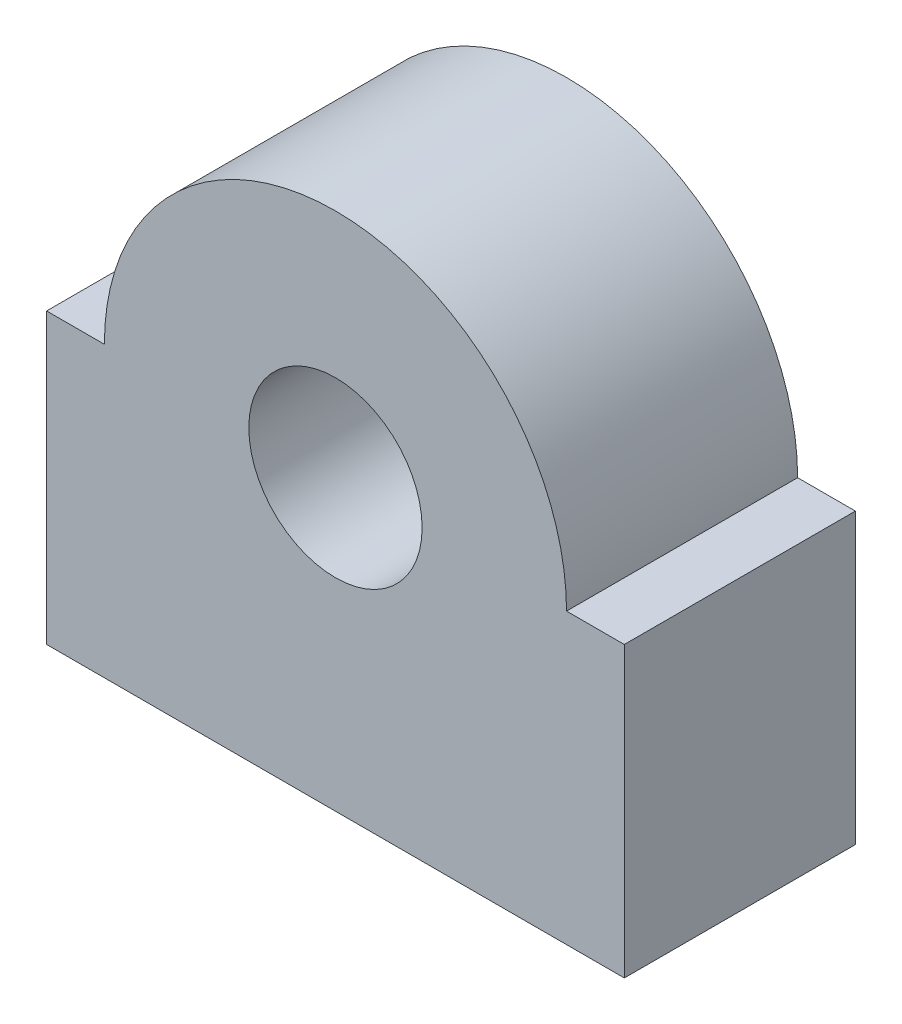
ISO-10303-21;
HEADER;
FILE_DESCRIPTION(('STEP AP214'),'2;1');
FILE_NAME('part.step','',(''),(''),'','','');
FILE_SCHEMA(('AUTOMOTIVE_DESIGN { 1 0 10303 214 1 1 1 1 }'));
ENDSEC;
DATA;
#1=APPLICATION_CONTEXT('core data for automotive mechanical design processes');
#2=APPLICATION_PROTOCOL_DEFINITION('international standard','automotive_design',2000,#1);
#3=PRODUCT_CONTEXT('',#1,'mechanical');
#4=PRODUCT('Part','Part','',(#3));
#5=PRODUCT_RELATED_PRODUCT_CATEGORY('part','',(#4));
#6=PRODUCT_DEFINITION_FORMATION('','',#4);
#7=PRODUCT_DEFINITION_CONTEXT('part definition',#1,'design');
#8=PRODUCT_DEFINITION('design','',#6,#7);
#9=PRODUCT_DEFINITION_SHAPE('','',#8);
#10=(LENGTH_UNIT() NAMED_UNIT(*) SI_UNIT(.MILLI.,.METRE.));
#11=(NAMED_UNIT(*) PLANE_ANGLE_UNIT() SI_UNIT($,.RADIAN.));
#12=(NAMED_UNIT(*) SI_UNIT($,.STERADIAN.) SOLID_ANGLE_UNIT());
#13=UNCERTAINTY_MEASURE_WITH_UNIT(LENGTH_MEASURE(1.E-05),#10,'distance_accuracy_value','');
#14=(GEOMETRIC_REPRESENTATION_CONTEXT(3) GLOBAL_UNCERTAINTY_ASSIGNED_CONTEXT((#13)) GLOBAL_UNIT_ASSIGNED_CONTEXT((#10,
#11,#12)) REPRESENTATION_CONTEXT('',''));
#15=CARTESIAN_POINT('',(0.,0.,0.));
#16=DIRECTION('',(0.,0.,1.));
#17=DIRECTION('',(1.,0.,0.));
#18=AXIS2_PLACEMENT_3D('',#15,#16,#17);
#19=CARTESIAN_POINT('',(0.,63.5,50.8));
#20=DIRECTION('',(0.,0.,-1.));
#21=DIRECTION('',(-1.,0.,0.));
#22=AXIS2_PLACEMENT_3D('',#19,#20,#21);
#23=PLANE('',#22);
#24=DIRECTION('',(0.,-1.,0.));
#25=VECTOR('',#24,1.);
#26=CARTESIAN_POINT('',(-63.5,0.,50.8));
#27=LINE('',#26,#25);
#28=CARTESIAN_POINT('',(-63.5,63.5,50.8));
#29=VERTEX_POINT('',#28);
#30=CARTESIAN_POINT('',(-63.5,0.,50.8));
#31=VERTEX_POINT('',#30);
#32=EDGE_CURVE('E129',#29,#31,#27,.T.);
#33=ORIENTED_EDGE('',*,*,#32,.T.);
#34=DIRECTION('',(1.,0.,0.));
#35=VECTOR('',#34,1.);
#36=CARTESIAN_POINT('',(-63.5,0.,50.8));
#37=LINE('',#36,#35);
#38=CARTESIAN_POINT('',(63.5,0.,50.8));
#39=VERTEX_POINT('',#38);
#40=EDGE_CURVE('E87',#31,#39,#37,.T.);
#41=ORIENTED_EDGE('',*,*,#40,.T.);
#42=DIRECTION('',(0.,1.,0.));
#43=VECTOR('',#42,1.);
#44=CARTESIAN_POINT('',(63.5,0.,50.8));
#45=LINE('',#44,#43);
#46=CARTESIAN_POINT('',(63.5,63.5,50.8));
#47=VERTEX_POINT('',#46);
#48=EDGE_CURVE('E100',#39,#47,#45,.T.);
#49=ORIENTED_EDGE('',*,*,#48,.T.);
#50=DIRECTION('',(-1.,0.,0.));
#51=VECTOR('',#50,1.);
#52=CARTESIAN_POINT('',(50.8,63.5,50.8));
#53=LINE('',#52,#51);
#54=CARTESIAN_POINT('',(50.8,63.5,50.8));
#55=VERTEX_POINT('',#54);
#56=EDGE_CURVE('E94',#47,#55,#53,.T.);
#57=ORIENTED_EDGE('',*,*,#56,.T.);
#58=CARTESIAN_POINT('',(0.,63.5,50.8));
#59=DIRECTION('',(0.,0.,1.));
#60=DIRECTION('',(-1.,0.,0.));
#61=AXIS2_PLACEMENT_3D('',#58,#59,#60);
#62=CIRCLE('',#61,50.8);
#63=CARTESIAN_POINT('',(-50.8,63.5,50.8));
#64=VERTEX_POINT('',#63);
#65=EDGE_CURVE('E98',#55,#64,#62,.T.);
#66=ORIENTED_EDGE('',*,*,#65,.T.);
#67=DIRECTION('',(-1.,0.,0.));
#68=VECTOR('',#67,1.);
#69=CARTESIAN_POINT('',(-63.5,63.5,50.8));
#70=LINE('',#69,#68);
#71=EDGE_CURVE('E50',#64,#29,#70,.T.);
#72=ORIENTED_EDGE('',*,*,#71,.T.);
#73=EDGE_LOOP('',(#33,#41,#49,#57,#66,#72));
#74=FACE_BOUND('',#73,.T.);
#75=CARTESIAN_POINT('',(0.,63.5,50.8));
#76=DIRECTION('',(0.,0.,1.));
#77=DIRECTION('',(1.,0.,0.));
#78=AXIS2_PLACEMENT_3D('',#75,#76,#77);
#79=CIRCLE('',#78,19.05);
#80=CARTESIAN_POINT('',(19.05,63.5,50.8));
#81=VERTEX_POINT('',#80);
#82=EDGE_CURVE('E122',#81,#81,#79,.T.);
#83=ORIENTED_EDGE('',*,*,#82,.F.);
#84=EDGE_LOOP('',(#83));
#85=FACE_BOUND('',#84,.T.);
#86=ADVANCED_FACE('F33',(#74,#85),#23,.F.);
#87=CARTESIAN_POINT('',(0.,63.5,0.));
#88=DIRECTION('',(0.,0.,-1.));
#89=DIRECTION('',(-1.,0.,0.));
#90=AXIS2_PLACEMENT_3D('',#87,#88,#89);
#91=PLANE('',#90);
#92=DIRECTION('',(0.,-1.,0.));
#93=VECTOR('',#92,1.);
#94=CARTESIAN_POINT('',(-63.5,0.,0.));
#95=LINE('',#94,#93);
#96=CARTESIAN_POINT('',(-63.5,63.5,0.));
#97=VERTEX_POINT('',#96);
#98=CARTESIAN_POINT('',(-63.5,0.,0.));
#99=VERTEX_POINT('',#98);
#100=EDGE_CURVE('E118',#97,#99,#95,.T.);
#101=ORIENTED_EDGE('',*,*,#100,.F.);
#102=DIRECTION('',(-1.,0.,0.));
#103=VECTOR('',#102,1.);
#104=CARTESIAN_POINT('',(-63.5,63.5,0.));
#105=LINE('',#104,#103);
#106=CARTESIAN_POINT('',(-50.8,63.5,0.));
#107=VERTEX_POINT('',#106);
#108=EDGE_CURVE('E79',#107,#97,#105,.T.);
#109=ORIENTED_EDGE('',*,*,#108,.F.);
#110=CARTESIAN_POINT('',(0.,63.5,0.));
#111=DIRECTION('',(0.,0.,1.));
#112=DIRECTION('',(-1.,0.,0.));
#113=AXIS2_PLACEMENT_3D('',#110,#111,#112);
#114=CIRCLE('',#113,50.8);
#115=CARTESIAN_POINT('',(50.8,63.5,0.));
#116=VERTEX_POINT('',#115);
#117=EDGE_CURVE('E73',#116,#107,#114,.T.);
#118=ORIENTED_EDGE('',*,*,#117,.F.);
#119=DIRECTION('',(-1.,0.,0.));
#120=VECTOR('',#119,1.);
#121=CARTESIAN_POINT('',(50.8,63.5,0.));
#122=LINE('',#121,#120);
#123=CARTESIAN_POINT('',(63.5,63.5,0.));
#124=VERTEX_POINT('',#123);
#125=EDGE_CURVE('E108',#124,#116,#122,.T.);
#126=ORIENTED_EDGE('',*,*,#125,.F.);
#127=DIRECTION('',(0.,1.,0.));
#128=VECTOR('',#127,1.);
#129=CARTESIAN_POINT('',(63.5,0.,0.));
#130=LINE('',#129,#128);
#131=CARTESIAN_POINT('',(63.5,0.,0.));
#132=VERTEX_POINT('',#131);
#133=EDGE_CURVE('E124',#132,#124,#130,.T.);
#134=ORIENTED_EDGE('',*,*,#133,.F.);
#135=DIRECTION('',(1.,0.,0.));
#136=VECTOR('',#135,1.);
#137=CARTESIAN_POINT('',(-63.5,0.,0.));
#138=LINE('',#137,#136);
#139=EDGE_CURVE('E121',#99,#132,#138,.T.);
#140=ORIENTED_EDGE('',*,*,#139,.F.);
#141=EDGE_LOOP('',(#101,#109,#118,#126,#134,#140));
#142=FACE_BOUND('',#141,.T.);
#143=CARTESIAN_POINT('',(0.,63.5,0.));
#144=DIRECTION('',(0.,0.,1.));
#145=DIRECTION('',(1.,0.,0.));
#146=AXIS2_PLACEMENT_3D('',#143,#144,#145);
#147=CIRCLE('',#146,19.05);
#148=CARTESIAN_POINT('',(19.05,63.5,0.));
#149=VERTEX_POINT('',#148);
#150=EDGE_CURVE('E222',#149,#149,#147,.T.);
#151=ORIENTED_EDGE('',*,*,#150,.T.);
#152=EDGE_LOOP('',(#151));
#153=FACE_BOUND('',#152,.T.);
#154=ADVANCED_FACE('F138',(#142,#153),#91,.T.);
#155=CARTESIAN_POINT('',(-63.5,0.,50.8));
#156=DIRECTION('',(1.,0.,0.));
#157=DIRECTION('',(0.,0.,-1.));
#158=AXIS2_PLACEMENT_3D('',#155,#156,#157);
#159=PLANE('',#158);
#160=ORIENTED_EDGE('',*,*,#100,.T.);
#161=DIRECTION('',(0.,0.,-1.));
#162=VECTOR('',#161,1.);
#163=CARTESIAN_POINT('',(-63.5,0.,50.8));
#164=LINE('',#163,#162);
#165=EDGE_CURVE('E11',#31,#99,#164,.T.);
#166=ORIENTED_EDGE('',*,*,#165,.F.);
#167=ORIENTED_EDGE('',*,*,#32,.F.);
#168=DIRECTION('',(0.,0.,-1.));
#169=VECTOR('',#168,1.);
#170=CARTESIAN_POINT('',(-63.5,63.5,50.8));
#171=LINE('',#170,#169);
#172=EDGE_CURVE('E114',#29,#97,#171,.T.);
#173=ORIENTED_EDGE('',*,*,#172,.T.);
#174=EDGE_LOOP('',(#160,#166,#167,#173));
#175=FACE_BOUND('',#174,.T.);
#176=ADVANCED_FACE('F35',(#175),#159,.F.);
#177=CARTESIAN_POINT('',(-63.5,0.,50.8));
#178=DIRECTION('',(0.,1.,0.));
#179=DIRECTION('',(0.,0.,1.));
#180=AXIS2_PLACEMENT_3D('',#177,#178,#179);
#181=PLANE('',#180);
#182=ORIENTED_EDGE('',*,*,#139,.T.);
#183=DIRECTION('',(0.,0.,-1.));
#184=VECTOR('',#183,1.);
#185=CARTESIAN_POINT('',(63.5,0.,50.8));
#186=LINE('',#185,#184);
#187=EDGE_CURVE('E42',#39,#132,#186,.T.);
#188=ORIENTED_EDGE('',*,*,#187,.F.);
#189=ORIENTED_EDGE('',*,*,#40,.F.);
#190=ORIENTED_EDGE('',*,*,#165,.T.);
#191=EDGE_LOOP('',(#182,#188,#189,#190));
#192=FACE_BOUND('',#191,.T.);
#193=ADVANCED_FACE('F163',(#192),#181,.F.);
#194=CARTESIAN_POINT('',(63.5,0.,50.8));
#195=DIRECTION('',(-1.,0.,0.));
#196=DIRECTION('',(0.,0.,1.));
#197=AXIS2_PLACEMENT_3D('',#194,#195,#196);
#198=PLANE('',#197);
#199=ORIENTED_EDGE('',*,*,#133,.T.);
#200=DIRECTION('',(0.,0.,-1.));
#201=VECTOR('',#200,1.);
#202=CARTESIAN_POINT('',(63.5,63.5,50.8));
#203=LINE('',#202,#201);
#204=EDGE_CURVE('E109',#47,#124,#203,.T.);
#205=ORIENTED_EDGE('',*,*,#204,.F.);
#206=ORIENTED_EDGE('',*,*,#48,.F.);
#207=ORIENTED_EDGE('',*,*,#187,.T.);
#208=EDGE_LOOP('',(#199,#205,#206,#207));
#209=FACE_BOUND('',#208,.T.);
#210=ADVANCED_FACE('F135',(#209),#198,.F.);
#211=CARTESIAN_POINT('',(50.8,63.5,50.8));
#212=DIRECTION('',(0.,-1.,0.));
#213=DIRECTION('',(0.,0.,-1.));
#214=AXIS2_PLACEMENT_3D('',#211,#212,#213);
#215=PLANE('',#214);
#216=ORIENTED_EDGE('',*,*,#125,.T.);
#217=DIRECTION('',(0.,0.,-1.));
#218=VECTOR('',#217,1.);
#219=CARTESIAN_POINT('',(50.8,63.5,50.8));
#220=LINE('',#219,#218);
#221=EDGE_CURVE('E105',#55,#116,#220,.T.);
#222=ORIENTED_EDGE('',*,*,#221,.F.);
#223=ORIENTED_EDGE('',*,*,#56,.F.);
#224=ORIENTED_EDGE('',*,*,#204,.T.);
#225=EDGE_LOOP('',(#216,#222,#223,#224));
#226=FACE_BOUND('',#225,.T.);
#227=ADVANCED_FACE('F106',(#226),#215,.F.);
#228=CARTESIAN_POINT('',(0.,63.5,50.8));
#229=DIRECTION('',(0.,0.,-1.));
#230=DIRECTION('',(-1.,0.,0.));
#231=AXIS2_PLACEMENT_3D('',#228,#229,#230);
#232=CYLINDRICAL_SURFACE('',#231,50.8);
#233=ORIENTED_EDGE('',*,*,#117,.T.);
#234=DIRECTION('',(0.,0.,-1.));
#235=VECTOR('',#234,1.);
#236=CARTESIAN_POINT('',(-50.8,63.5,50.8));
#237=LINE('',#236,#235);
#238=EDGE_CURVE('E110',#64,#107,#237,.T.);
#239=ORIENTED_EDGE('',*,*,#238,.F.);
#240=ORIENTED_EDGE('',*,*,#65,.F.);
#241=ORIENTED_EDGE('',*,*,#221,.T.);
#242=EDGE_LOOP('',(#233,#239,#240,#241));
#243=FACE_BOUND('',#242,.T.);
#244=ADVANCED_FACE('F112',(#243),#232,.T.);
#245=CARTESIAN_POINT('',(-63.5,63.5,50.8));
#246=DIRECTION('',(0.,-1.,0.));
#247=DIRECTION('',(0.,0.,-1.));
#248=AXIS2_PLACEMENT_3D('',#245,#246,#247);
#249=PLANE('',#248);
#250=ORIENTED_EDGE('',*,*,#108,.T.);
#251=ORIENTED_EDGE('',*,*,#172,.F.);
#252=ORIENTED_EDGE('',*,*,#71,.F.);
#253=ORIENTED_EDGE('',*,*,#238,.T.);
#254=EDGE_LOOP('',(#250,#251,#252,#253));
#255=FACE_BOUND('',#254,.T.);
#256=ADVANCED_FACE('F143',(#255),#249,.F.);
#257=CARTESIAN_POINT('',(0.,63.5,50.8));
#258=DIRECTION('',(0.,0.,-1.));
#259=DIRECTION('',(-1.,0.,0.));
#260=AXIS2_PLACEMENT_3D('',#257,#258,#259);
#261=CYLINDRICAL_SURFACE('',#260,19.05);
#262=ORIENTED_EDGE('',*,*,#82,.T.);
#263=EDGE_LOOP('',(#262));
#264=FACE_BOUND('',#263,.T.);
#265=ORIENTED_EDGE('',*,*,#150,.F.);
#266=EDGE_LOOP('',(#265));
#267=FACE_BOUND('',#266,.T.);
#268=ADVANCED_FACE('F145',(#264,#267),#261,.F.);
#269=CLOSED_SHELL('',(#86,#154,#176,#193,#210,#227,#244,#256,#268));
#270=MANIFOLD_SOLID_BREP('B2',#269);
#271=ADVANCED_BREP_SHAPE_REPRESENTATION('',(#18,#270),#14);
#272=SHAPE_DEFINITION_REPRESENTATION(#9,#271);
ENDSEC;
END-ISO-10303-21;
